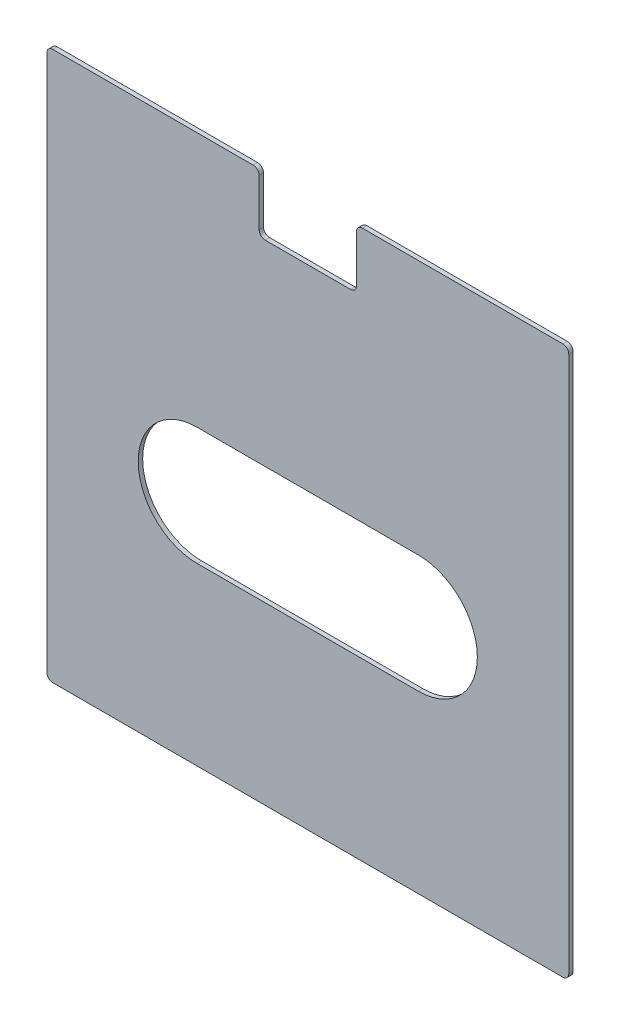
ISO-10303-21;
HEADER;
FILE_DESCRIPTION(('STEP AP214'),'2;1');
FILE_NAME('part.step','',(''),(''),'','','');
FILE_SCHEMA(('AUTOMOTIVE_DESIGN { 1 0 10303 214 1 1 1 1 }'));
ENDSEC;
DATA;
#1=APPLICATION_CONTEXT('core data for automotive mechanical design processes');
#2=APPLICATION_PROTOCOL_DEFINITION('international standard','automotive_design',2000,#1);
#3=PRODUCT_CONTEXT('',#1,'mechanical');
#4=PRODUCT('Part','Part','',(#3));
#5=PRODUCT_RELATED_PRODUCT_CATEGORY('part','',(#4));
#6=PRODUCT_DEFINITION_FORMATION('','',#4);
#7=PRODUCT_DEFINITION_CONTEXT('part definition',#1,'design');
#8=PRODUCT_DEFINITION('design','',#6,#7);
#9=PRODUCT_DEFINITION_SHAPE('','',#8);
#10=(LENGTH_UNIT() NAMED_UNIT(*) SI_UNIT(.MILLI.,.METRE.));
#11=(NAMED_UNIT(*) PLANE_ANGLE_UNIT() SI_UNIT($,.RADIAN.));
#12=(NAMED_UNIT(*) SI_UNIT($,.STERADIAN.) SOLID_ANGLE_UNIT());
#13=UNCERTAINTY_MEASURE_WITH_UNIT(LENGTH_MEASURE(1.E-05),#10,'distance_accuracy_value','');
#14=(GEOMETRIC_REPRESENTATION_CONTEXT(3) GLOBAL_UNCERTAINTY_ASSIGNED_CONTEXT((#13)) GLOBAL_UNIT_ASSIGNED_CONTEXT((#10,
#11,#12)) REPRESENTATION_CONTEXT('',''));
#15=CARTESIAN_POINT('',(0.,0.,0.));
#16=DIRECTION('',(0.,0.,1.));
#17=DIRECTION('',(1.,0.,0.));
#18=AXIS2_PLACEMENT_3D('',#15,#16,#17);
#19=CARTESIAN_POINT('',(0.,186.,1.5));
#20=DIRECTION('',(1.,0.,0.));
#21=DIRECTION('',(0.,1.,0.));
#22=AXIS2_PLACEMENT_3D('',#19,#20,#21);
#23=PLANE('',#22);
#24=DIRECTION('',(0.,-1.,0.));
#25=VECTOR('',#24,1.);
#26=CARTESIAN_POINT('',(0.,186.,0.));
#27=LINE('',#26,#25);
#28=CARTESIAN_POINT('',(0.,184.,0.));
#29=VERTEX_POINT('',#28);
#30=CARTESIAN_POINT('',(0.,2.00000000000006,0.));
#31=VERTEX_POINT('',#30);
#32=EDGE_CURVE('E204',#29,#31,#27,.T.);
#33=ORIENTED_EDGE('',*,*,#32,.T.);
#34=DIRECTION('',(0.,0.,-1.));
#35=VECTOR('',#34,1.);
#36=CARTESIAN_POINT('',(0.,2.,1.5));
#37=LINE('',#36,#35);
#38=CARTESIAN_POINT('',(0.,2.00000000000006,1.5));
#39=VERTEX_POINT('',#38);
#40=EDGE_CURVE('E314',#31,#39,#37,.F.);
#41=ORIENTED_EDGE('',*,*,#40,.T.);
#42=DIRECTION('',(0.,-1.,0.));
#43=VECTOR('',#42,1.);
#44=CARTESIAN_POINT('',(0.,186.,1.5));
#45=LINE('',#44,#43);
#46=CARTESIAN_POINT('',(0.,184.,1.5));
#47=VERTEX_POINT('',#46);
#48=EDGE_CURVE('E205',#47,#39,#45,.T.);
#49=ORIENTED_EDGE('',*,*,#48,.F.);
#50=DIRECTION('',(0.,0.,-1.));
#51=VECTOR('',#50,1.);
#52=CARTESIAN_POINT('',(0.,184.,1.5));
#53=LINE('',#52,#51);
#54=EDGE_CURVE('E311',#47,#29,#53,.T.);
#55=ORIENTED_EDGE('',*,*,#54,.T.);
#56=EDGE_LOOP('',(#33,#41,#49,#55));
#57=FACE_BOUND('',#56,.T.);
#58=ADVANCED_FACE('F33',(#57),#23,.F.);
#59=CARTESIAN_POINT('',(0.,0.,1.5));
#60=DIRECTION('',(0.,1.,0.));
#61=DIRECTION('',(-1.,0.,0.));
#62=AXIS2_PLACEMENT_3D('',#59,#60,#61);
#63=PLANE('',#62);
#64=DIRECTION('',(1.,0.,0.));
#65=VECTOR('',#64,1.);
#66=CARTESIAN_POINT('',(0.,0.,0.));
#67=LINE('',#66,#65);
#68=CARTESIAN_POINT('',(2.,0.,0.));
#69=VERTEX_POINT('',#68);
#70=CARTESIAN_POINT('',(175.,0.,0.));
#71=VERTEX_POINT('',#70);
#72=EDGE_CURVE('E233',#69,#71,#67,.T.);
#73=ORIENTED_EDGE('',*,*,#72,.T.);
#74=DIRECTION('',(0.,0.,-1.));
#75=VECTOR('',#74,1.);
#76=CARTESIAN_POINT('',(175.,0.,1.5));
#77=LINE('',#76,#75);
#78=CARTESIAN_POINT('',(175.,0.,1.5));
#79=VERTEX_POINT('',#78);
#80=EDGE_CURVE('E309',#71,#79,#77,.F.);
#81=ORIENTED_EDGE('',*,*,#80,.T.);
#82=DIRECTION('',(1.,0.,0.));
#83=VECTOR('',#82,1.);
#84=CARTESIAN_POINT('',(0.,0.,1.5));
#85=LINE('',#84,#83);
#86=CARTESIAN_POINT('',(2.,0.,1.5));
#87=VERTEX_POINT('',#86);
#88=EDGE_CURVE('E208',#87,#79,#85,.T.);
#89=ORIENTED_EDGE('',*,*,#88,.F.);
#90=DIRECTION('',(0.,0.,-1.));
#91=VECTOR('',#90,1.);
#92=CARTESIAN_POINT('',(2.,0.,1.5));
#93=LINE('',#92,#91);
#94=EDGE_CURVE('E306',#87,#69,#93,.T.);
#95=ORIENTED_EDGE('',*,*,#94,.T.);
#96=EDGE_LOOP('',(#73,#81,#89,#95));
#97=FACE_BOUND('',#96,.T.);
#98=ADVANCED_FACE('F360',(#97),#63,.F.);
#99=CARTESIAN_POINT('',(177.,0.,1.5));
#100=DIRECTION('',(-1.,0.,0.));
#101=DIRECTION('',(0.,-1.,0.));
#102=AXIS2_PLACEMENT_3D('',#99,#100,#101);
#103=PLANE('',#102);
#104=DIRECTION('',(0.,1.,0.));
#105=VECTOR('',#104,1.);
#106=CARTESIAN_POINT('',(177.,0.,1.5));
#107=LINE('',#106,#105);
#108=CARTESIAN_POINT('',(177.,2.00000000000001,1.5));
#109=VERTEX_POINT('',#108);
#110=CARTESIAN_POINT('',(177.,184.,1.5));
#111=VERTEX_POINT('',#110);
#112=EDGE_CURVE('E212',#109,#111,#107,.T.);
#113=ORIENTED_EDGE('',*,*,#112,.F.);
#114=DIRECTION('',(0.,0.,-1.));
#115=VECTOR('',#114,1.);
#116=CARTESIAN_POINT('',(177.,2.00000000000001,1.5));
#117=LINE('',#116,#115);
#118=CARTESIAN_POINT('',(177.,2.00000000000001,0.));
#119=VERTEX_POINT('',#118);
#120=EDGE_CURVE('E303',#109,#119,#117,.T.);
#121=ORIENTED_EDGE('',*,*,#120,.T.);
#122=DIRECTION('',(0.,1.,0.));
#123=VECTOR('',#122,1.);
#124=CARTESIAN_POINT('',(177.,0.,0.));
#125=LINE('',#124,#123);
#126=CARTESIAN_POINT('',(177.,184.,0.));
#127=VERTEX_POINT('',#126);
#128=EDGE_CURVE('E236',#119,#127,#125,.T.);
#129=ORIENTED_EDGE('',*,*,#128,.T.);
#130=DIRECTION('',(0.,0.,-1.));
#131=VECTOR('',#130,1.);
#132=CARTESIAN_POINT('',(177.,184.,1.5));
#133=LINE('',#132,#131);
#134=EDGE_CURVE('E301',#127,#111,#133,.F.);
#135=ORIENTED_EDGE('',*,*,#134,.T.);
#136=EDGE_LOOP('',(#113,#121,#129,#135));
#137=FACE_BOUND('',#136,.T.);
#138=ADVANCED_FACE('F369',(#137),#103,.F.);
#139=CARTESIAN_POINT('',(177.,186.,1.5));
#140=DIRECTION('',(0.,-1.,0.));
#141=DIRECTION('',(0.,0.,-1.));
#142=AXIS2_PLACEMENT_3D('',#139,#140,#141);
#143=PLANE('',#142);
#144=DIRECTION('',(-1.,0.,0.));
#145=VECTOR('',#144,1.);
#146=CARTESIAN_POINT('',(177.,186.,0.));
#147=LINE('',#146,#145);
#148=CARTESIAN_POINT('',(175.,186.,0.));
#149=VERTEX_POINT('',#148);
#150=CARTESIAN_POINT('',(107.,186.,0.));
#151=VERTEX_POINT('',#150);
#152=EDGE_CURVE('E239',#149,#151,#147,.T.);
#153=ORIENTED_EDGE('',*,*,#152,.T.);
#154=DIRECTION('',(0.,0.,-1.));
#155=VECTOR('',#154,1.);
#156=CARTESIAN_POINT('',(107.,186.,1.5));
#157=LINE('',#156,#155);
#158=CARTESIAN_POINT('',(107.,186.,1.5));
#159=VERTEX_POINT('',#158);
#160=EDGE_CURVE('E282',#151,#159,#157,.F.);
#161=ORIENTED_EDGE('',*,*,#160,.T.);
#162=DIRECTION('',(-1.,0.,0.));
#163=VECTOR('',#162,1.);
#164=CARTESIAN_POINT('',(177.,186.,1.5));
#165=LINE('',#164,#163);
#166=CARTESIAN_POINT('',(175.,186.,1.5));
#167=VERTEX_POINT('',#166);
#168=EDGE_CURVE('E215',#167,#159,#165,.T.);
#169=ORIENTED_EDGE('',*,*,#168,.F.);
#170=DIRECTION('',(0.,0.,-1.));
#171=VECTOR('',#170,1.);
#172=CARTESIAN_POINT('',(175.,186.,1.5));
#173=LINE('',#172,#171);
#174=EDGE_CURVE('E279',#167,#149,#173,.T.);
#175=ORIENTED_EDGE('',*,*,#174,.T.);
#176=EDGE_LOOP('',(#153,#161,#169,#175));
#177=FACE_BOUND('',#176,.T.);
#178=ADVANCED_FACE('F378',(#177),#143,.F.);
#179=CARTESIAN_POINT('',(105.,186.,1.5));
#180=DIRECTION('',(1.,0.,0.));
#181=DIRECTION('',(0.,1.,0.));
#182=AXIS2_PLACEMENT_3D('',#179,#180,#181);
#183=PLANE('',#182);
#184=DIRECTION('',(0.,-1.,0.));
#185=VECTOR('',#184,1.);
#186=CARTESIAN_POINT('',(105.,186.,0.));
#187=LINE('',#186,#185);
#188=CARTESIAN_POINT('',(105.,184.,0.));
#189=VERTEX_POINT('',#188);
#190=CARTESIAN_POINT('',(105.,168.,0.));
#191=VERTEX_POINT('',#190);
#192=EDGE_CURVE('E242',#189,#191,#187,.T.);
#193=ORIENTED_EDGE('',*,*,#192,.T.);
#194=DIRECTION('',(0.,0.,-1.));
#195=VECTOR('',#194,1.);
#196=CARTESIAN_POINT('',(105.,168.,1.5));
#197=LINE('',#196,#195);
#198=CARTESIAN_POINT('',(105.,168.,1.5));
#199=VERTEX_POINT('',#198);
#200=EDGE_CURVE('E260',#191,#199,#197,.F.);
#201=ORIENTED_EDGE('',*,*,#200,.T.);
#202=DIRECTION('',(0.,-1.,0.));
#203=VECTOR('',#202,1.);
#204=CARTESIAN_POINT('',(105.,186.,1.5));
#205=LINE('',#204,#203);
#206=CARTESIAN_POINT('',(105.,184.,1.5));
#207=VERTEX_POINT('',#206);
#208=EDGE_CURVE('E218',#207,#199,#205,.T.);
#209=ORIENTED_EDGE('',*,*,#208,.F.);
#210=DIRECTION('',(0.,0.,-1.));
#211=VECTOR('',#210,1.);
#212=CARTESIAN_POINT('',(105.,184.,1.5));
#213=LINE('',#212,#211);
#214=EDGE_CURVE('E257',#207,#189,#213,.T.);
#215=ORIENTED_EDGE('',*,*,#214,.T.);
#216=EDGE_LOOP('',(#193,#201,#209,#215));
#217=FACE_BOUND('',#216,.T.);
#218=ADVANCED_FACE('F387',(#217),#183,.F.);
#219=CARTESIAN_POINT('',(105.,166.,1.5));
#220=DIRECTION('',(0.,-1.,0.));
#221=DIRECTION('',(0.,0.,-1.));
#222=AXIS2_PLACEMENT_3D('',#219,#220,#221);
#223=PLANE('',#222);
#224=DIRECTION('',(-1.,0.,0.));
#225=VECTOR('',#224,1.);
#226=CARTESIAN_POINT('',(105.,166.,1.5));
#227=LINE('',#226,#225);
#228=CARTESIAN_POINT('',(103.,166.,1.5));
#229=VERTEX_POINT('',#228);
#230=CARTESIAN_POINT('',(74.,166.,1.5));
#231=VERTEX_POINT('',#230);
#232=EDGE_CURVE('E221',#229,#231,#227,.T.);
#233=ORIENTED_EDGE('',*,*,#232,.F.);
#234=DIRECTION('',(0.,0.,-1.));
#235=VECTOR('',#234,1.);
#236=CARTESIAN_POINT('',(103.,166.,0.));
#237=LINE('',#236,#235);
#238=CARTESIAN_POINT('',(103.,166.,0.));
#239=VERTEX_POINT('',#238);
#240=EDGE_CURVE('E254',#229,#239,#237,.T.);
#241=ORIENTED_EDGE('',*,*,#240,.T.);
#242=DIRECTION('',(-1.,0.,0.));
#243=VECTOR('',#242,1.);
#244=CARTESIAN_POINT('',(105.,166.,0.));
#245=LINE('',#244,#243);
#246=CARTESIAN_POINT('',(74.,166.,0.));
#247=VERTEX_POINT('',#246);
#248=EDGE_CURVE('E245',#239,#247,#245,.T.);
#249=ORIENTED_EDGE('',*,*,#248,.T.);
#250=DIRECTION('',(0.,0.,-1.));
#251=VECTOR('',#250,1.);
#252=CARTESIAN_POINT('',(74.,166.,1.5));
#253=LINE('',#252,#251);
#254=EDGE_CURVE('E230',#247,#231,#253,.F.);
#255=ORIENTED_EDGE('',*,*,#254,.T.);
#256=EDGE_LOOP('',(#233,#241,#249,#255));
#257=FACE_BOUND('',#256,.T.);
#258=ADVANCED_FACE('F327',(#257),#223,.F.);
#259=CARTESIAN_POINT('',(72.,166.,1.5));
#260=DIRECTION('',(-1.,0.,0.));
#261=DIRECTION('',(0.,0.,1.));
#262=AXIS2_PLACEMENT_3D('',#259,#260,#261);
#263=PLANE('',#262);
#264=DIRECTION('',(0.,1.,0.));
#265=VECTOR('',#264,1.);
#266=CARTESIAN_POINT('',(72.,166.,1.5));
#267=LINE('',#266,#265);
#268=CARTESIAN_POINT('',(72.,168.,1.5));
#269=VERTEX_POINT('',#268);
#270=CARTESIAN_POINT('',(72.,184.,1.5));
#271=VERTEX_POINT('',#270);
#272=EDGE_CURVE('E224',#269,#271,#267,.T.);
#273=ORIENTED_EDGE('',*,*,#272,.F.);
#274=DIRECTION('',(0.,0.,-1.));
#275=VECTOR('',#274,1.);
#276=CARTESIAN_POINT('',(72.,168.,0.));
#277=LINE('',#276,#275);
#278=CARTESIAN_POINT('',(72.,168.,0.));
#279=VERTEX_POINT('',#278);
#280=EDGE_CURVE('E264',#269,#279,#277,.T.);
#281=ORIENTED_EDGE('',*,*,#280,.T.);
#282=DIRECTION('',(0.,1.,0.));
#283=VECTOR('',#282,1.);
#284=CARTESIAN_POINT('',(72.,166.,0.));
#285=LINE('',#284,#283);
#286=CARTESIAN_POINT('',(72.,184.,0.));
#287=VERTEX_POINT('',#286);
#288=EDGE_CURVE('E248',#279,#287,#285,.T.);
#289=ORIENTED_EDGE('',*,*,#288,.T.);
#290=DIRECTION('',(0.,0.,-1.));
#291=VECTOR('',#290,1.);
#292=CARTESIAN_POINT('',(72.,184.,1.5));
#293=LINE('',#292,#291);
#294=EDGE_CURVE('E262',#287,#271,#293,.F.);
#295=ORIENTED_EDGE('',*,*,#294,.T.);
#296=EDGE_LOOP('',(#273,#281,#289,#295));
#297=FACE_BOUND('',#296,.T.);
#298=ADVANCED_FACE('F336',(#297),#263,.F.);
#299=CARTESIAN_POINT('',(72.,186.,1.5));
#300=DIRECTION('',(0.,-1.,0.));
#301=DIRECTION('',(0.,0.,-1.));
#302=AXIS2_PLACEMENT_3D('',#299,#300,#301);
#303=PLANE('',#302);
#304=DIRECTION('',(-1.,0.,0.));
#305=VECTOR('',#304,1.);
#306=CARTESIAN_POINT('',(72.,186.,1.5));
#307=LINE('',#306,#305);
#308=CARTESIAN_POINT('',(70.,186.,1.5));
#309=VERTEX_POINT('',#308);
#310=CARTESIAN_POINT('',(1.99999999999999,186.,1.5));
#311=VERTEX_POINT('',#310);
#312=EDGE_CURVE('E227',#309,#311,#307,.T.);
#313=ORIENTED_EDGE('',*,*,#312,.F.);
#314=DIRECTION('',(0.,0.,-1.));
#315=VECTOR('',#314,1.);
#316=CARTESIAN_POINT('',(70.,186.,1.5));
#317=LINE('',#316,#315);
#318=CARTESIAN_POINT('',(70.,186.,0.));
#319=VERTEX_POINT('',#318);
#320=EDGE_CURVE('E298',#309,#319,#317,.T.);
#321=ORIENTED_EDGE('',*,*,#320,.T.);
#322=DIRECTION('',(-1.,0.,0.));
#323=VECTOR('',#322,1.);
#324=CARTESIAN_POINT('',(72.,186.,0.));
#325=LINE('',#324,#323);
#326=CARTESIAN_POINT('',(1.99999999999999,186.,0.));
#327=VERTEX_POINT('',#326);
#328=EDGE_CURVE('E209',#319,#327,#325,.T.);
#329=ORIENTED_EDGE('',*,*,#328,.T.);
#330=DIRECTION('',(0.,0.,-1.));
#331=VECTOR('',#330,1.);
#332=CARTESIAN_POINT('',(1.99999999999999,186.,1.5));
#333=LINE('',#332,#331);
#334=EDGE_CURVE('E296',#327,#311,#333,.F.);
#335=ORIENTED_EDGE('',*,*,#334,.T.);
#336=EDGE_LOOP('',(#313,#321,#329,#335));
#337=FACE_BOUND('',#336,.T.);
#338=ADVANCED_FACE('F344',(#337),#303,.F.);
#339=CARTESIAN_POINT('',(0.,0.,1.5));
#340=DIRECTION('',(0.,0.,1.));
#341=DIRECTION('',(1.,0.,0.));
#342=AXIS2_PLACEMENT_3D('',#339,#340,#341);
#343=PLANE('',#342);
#344=CARTESIAN_POINT('',(126.,79.5,1.5));
#345=DIRECTION('',(0.,0.,1.));
#346=DIRECTION('',(1.,0.,0.));
#347=AXIS2_PLACEMENT_3D('',#344,#345,#346);
#348=CIRCLE('',#347,20.);
#349=CARTESIAN_POINT('',(126.,59.5000000000001,1.5));
#350=VERTEX_POINT('',#349);
#351=CARTESIAN_POINT('',(126.,99.5,1.5));
#352=VERTEX_POINT('',#351);
#353=EDGE_CURVE('E202',#350,#352,#348,.T.);
#354=ORIENTED_EDGE('',*,*,#353,.F.);
#355=DIRECTION('',(1.,0.,0.));
#356=VECTOR('',#355,1.);
#357=CARTESIAN_POINT('',(0.,59.5000000000001,1.5));
#358=LINE('',#357,#356);
#359=CARTESIAN_POINT('',(51.,59.5000000000001,1.5));
#360=VERTEX_POINT('',#359);
#361=EDGE_CURVE('E195',#360,#350,#358,.T.);
#362=ORIENTED_EDGE('',*,*,#361,.F.);
#363=CARTESIAN_POINT('',(51.,79.5,1.5));
#364=DIRECTION('',(0.,0.,1.));
#365=DIRECTION('',(1.,0.,0.));
#366=AXIS2_PLACEMENT_3D('',#363,#364,#365);
#367=CIRCLE('',#366,20.);
#368=CARTESIAN_POINT('',(51.,99.5,1.5));
#369=VERTEX_POINT('',#368);
#370=EDGE_CURVE('E175',#369,#360,#367,.T.);
#371=ORIENTED_EDGE('',*,*,#370,.F.);
#372=DIRECTION('',(-1.,0.,0.));
#373=VECTOR('',#372,1.);
#374=CARTESIAN_POINT('',(0.,99.5,1.5));
#375=LINE('',#374,#373);
#376=EDGE_CURVE('E200',#352,#369,#375,.T.);
#377=ORIENTED_EDGE('',*,*,#376,.F.);
#378=EDGE_LOOP('',(#354,#362,#371,#377));
#379=FACE_BOUND('',#378,.T.);
#380=ORIENTED_EDGE('',*,*,#168,.T.);
#381=CARTESIAN_POINT('',(107.,184.,1.5));
#382=DIRECTION('',(0.,0.,1.));
#383=DIRECTION('',(1.,0.,0.));
#384=AXIS2_PLACEMENT_3D('',#381,#382,#383);
#385=CIRCLE('',#384,2.);
#386=EDGE_CURVE('E294',#159,#207,#385,.T.);
#387=ORIENTED_EDGE('',*,*,#386,.T.);
#388=ORIENTED_EDGE('',*,*,#208,.T.);
#389=CARTESIAN_POINT('',(103.,168.,1.5));
#390=DIRECTION('',(0.,0.,1.));
#391=DIRECTION('',(1.,0.,0.));
#392=AXIS2_PLACEMENT_3D('',#389,#390,#391);
#393=CIRCLE('',#392,2.);
#394=EDGE_CURVE('E318',#199,#229,#393,.F.);
#395=ORIENTED_EDGE('',*,*,#394,.T.);
#396=ORIENTED_EDGE('',*,*,#232,.T.);
#397=CARTESIAN_POINT('',(74.,168.,1.5));
#398=DIRECTION('',(0.,0.,1.));
#399=DIRECTION('',(1.,0.,0.));
#400=AXIS2_PLACEMENT_3D('',#397,#398,#399);
#401=CIRCLE('',#400,2.);
#402=EDGE_CURVE('E11',#231,#269,#401,.F.);
#403=ORIENTED_EDGE('',*,*,#402,.T.);
#404=ORIENTED_EDGE('',*,*,#272,.T.);
#405=CARTESIAN_POINT('',(70.,184.,1.5));
#406=DIRECTION('',(0.,0.,1.));
#407=DIRECTION('',(1.,0.,0.));
#408=AXIS2_PLACEMENT_3D('',#405,#406,#407);
#409=CIRCLE('',#408,2.);
#410=EDGE_CURVE('E292',#271,#309,#409,.T.);
#411=ORIENTED_EDGE('',*,*,#410,.T.);
#412=ORIENTED_EDGE('',*,*,#312,.T.);
#413=CARTESIAN_POINT('',(1.99999999999998,184.,1.5));
#414=DIRECTION('',(0.,0.,1.));
#415=DIRECTION('',(1.,0.,0.));
#416=AXIS2_PLACEMENT_3D('',#413,#414,#415);
#417=CIRCLE('',#416,2.);
#418=EDGE_CURVE('E284',#311,#47,#417,.T.);
#419=ORIENTED_EDGE('',*,*,#418,.T.);
#420=ORIENTED_EDGE('',*,*,#48,.T.);
#421=CARTESIAN_POINT('',(2.,2.,1.5));
#422=DIRECTION('',(0.,0.,1.));
#423=DIRECTION('',(1.,0.,0.));
#424=AXIS2_PLACEMENT_3D('',#421,#422,#423);
#425=CIRCLE('',#424,2.);
#426=EDGE_CURVE('E288',#39,#87,#425,.T.);
#427=ORIENTED_EDGE('',*,*,#426,.T.);
#428=ORIENTED_EDGE('',*,*,#88,.T.);
#429=CARTESIAN_POINT('',(175.,2.00000000000001,1.5));
#430=DIRECTION('',(0.,0.,1.));
#431=DIRECTION('',(1.,0.,0.));
#432=AXIS2_PLACEMENT_3D('',#429,#430,#431);
#433=CIRCLE('',#432,2.);
#434=EDGE_CURVE('E290',#79,#109,#433,.T.);
#435=ORIENTED_EDGE('',*,*,#434,.T.);
#436=ORIENTED_EDGE('',*,*,#112,.T.);
#437=CARTESIAN_POINT('',(175.,184.,1.5));
#438=DIRECTION('',(0.,0.,1.));
#439=DIRECTION('',(1.,0.,0.));
#440=AXIS2_PLACEMENT_3D('',#437,#438,#439);
#441=CIRCLE('',#440,2.);
#442=EDGE_CURVE('E286',#111,#167,#441,.T.);
#443=ORIENTED_EDGE('',*,*,#442,.T.);
#444=EDGE_LOOP('',(#380,#387,#388,#395,#396,#403,#404,#411,#412,#419,#420,#427,#428,#435,#436,#443));
#445=FACE_BOUND('',#444,.T.);
#446=ADVANCED_FACE('F333',(#379,#445),#343,.T.);
#447=CARTESIAN_POINT('',(0.,0.,0.));
#448=DIRECTION('',(0.,0.,1.));
#449=DIRECTION('',(1.,0.,0.));
#450=AXIS2_PLACEMENT_3D('',#447,#448,#449);
#451=PLANE('',#450);
#452=DIRECTION('',(-1.,0.,0.));
#453=VECTOR('',#452,1.);
#454=CARTESIAN_POINT('',(126.,59.5000000000001,0.));
#455=LINE('',#454,#453);
#456=CARTESIAN_POINT('',(126.,59.5000000000001,0.));
#457=VERTEX_POINT('',#456);
#458=CARTESIAN_POINT('',(51.,59.5000000000001,0.));
#459=VERTEX_POINT('',#458);
#460=EDGE_CURVE('E181',#457,#459,#455,.T.);
#461=ORIENTED_EDGE('',*,*,#460,.F.);
#462=CARTESIAN_POINT('',(126.,79.5,0.));
#463=DIRECTION('',(0.,0.,-1.));
#464=DIRECTION('',(-1.,0.,0.));
#465=AXIS2_PLACEMENT_3D('',#462,#463,#464);
#466=CIRCLE('',#465,20.);
#467=CARTESIAN_POINT('',(126.,99.5,0.));
#468=VERTEX_POINT('',#467);
#469=EDGE_CURVE('E56',#468,#457,#466,.T.);
#470=ORIENTED_EDGE('',*,*,#469,.F.);
#471=DIRECTION('',(1.,0.,0.));
#472=VECTOR('',#471,1.);
#473=CARTESIAN_POINT('',(126.,99.5,0.));
#474=LINE('',#473,#472);
#475=CARTESIAN_POINT('',(51.,99.5,0.));
#476=VERTEX_POINT('',#475);
#477=EDGE_CURVE('E188',#476,#468,#474,.T.);
#478=ORIENTED_EDGE('',*,*,#477,.F.);
#479=CARTESIAN_POINT('',(51.,79.5,0.));
#480=DIRECTION('',(0.,0.,-1.));
#481=DIRECTION('',(-1.,0.,0.));
#482=AXIS2_PLACEMENT_3D('',#479,#480,#481);
#483=CIRCLE('',#482,20.);
#484=EDGE_CURVE('E172',#459,#476,#483,.T.);
#485=ORIENTED_EDGE('',*,*,#484,.F.);
#486=EDGE_LOOP('',(#461,#470,#478,#485));
#487=FACE_BOUND('',#486,.T.);
#488=ORIENTED_EDGE('',*,*,#192,.F.);
#489=CARTESIAN_POINT('',(107.,184.,0.));
#490=DIRECTION('',(0.,0.,1.));
#491=DIRECTION('',(1.,0.,0.));
#492=AXIS2_PLACEMENT_3D('',#489,#490,#491);
#493=CIRCLE('',#492,2.);
#494=EDGE_CURVE('E277',#189,#151,#493,.F.);
#495=ORIENTED_EDGE('',*,*,#494,.T.);
#496=ORIENTED_EDGE('',*,*,#152,.F.);
#497=CARTESIAN_POINT('',(175.,184.,0.));
#498=DIRECTION('',(0.,0.,1.));
#499=DIRECTION('',(1.,0.,0.));
#500=AXIS2_PLACEMENT_3D('',#497,#498,#499);
#501=CIRCLE('',#500,2.);
#502=EDGE_CURVE('E269',#149,#127,#501,.F.);
#503=ORIENTED_EDGE('',*,*,#502,.T.);
#504=ORIENTED_EDGE('',*,*,#128,.F.);
#505=CARTESIAN_POINT('',(175.,2.00000000000001,0.));
#506=DIRECTION('',(0.,0.,1.));
#507=DIRECTION('',(1.,0.,0.));
#508=AXIS2_PLACEMENT_3D('',#505,#506,#507);
#509=CIRCLE('',#508,2.);
#510=EDGE_CURVE('E273',#119,#71,#509,.F.);
#511=ORIENTED_EDGE('',*,*,#510,.T.);
#512=ORIENTED_EDGE('',*,*,#72,.F.);
#513=CARTESIAN_POINT('',(2.,2.,0.));
#514=DIRECTION('',(0.,0.,1.));
#515=DIRECTION('',(1.,0.,0.));
#516=AXIS2_PLACEMENT_3D('',#513,#514,#515);
#517=CIRCLE('',#516,2.);
#518=EDGE_CURVE('E271',#69,#31,#517,.F.);
#519=ORIENTED_EDGE('',*,*,#518,.T.);
#520=ORIENTED_EDGE('',*,*,#32,.F.);
#521=CARTESIAN_POINT('',(1.99999999999998,184.,0.));
#522=DIRECTION('',(0.,0.,1.));
#523=DIRECTION('',(1.,0.,0.));
#524=AXIS2_PLACEMENT_3D('',#521,#522,#523);
#525=CIRCLE('',#524,2.);
#526=EDGE_CURVE('E267',#29,#327,#525,.F.);
#527=ORIENTED_EDGE('',*,*,#526,.T.);
#528=ORIENTED_EDGE('',*,*,#328,.F.);
#529=CARTESIAN_POINT('',(70.,184.,0.));
#530=DIRECTION('',(0.,0.,1.));
#531=DIRECTION('',(1.,0.,0.));
#532=AXIS2_PLACEMENT_3D('',#529,#530,#531);
#533=CIRCLE('',#532,2.);
#534=EDGE_CURVE('E275',#319,#287,#533,.F.);
#535=ORIENTED_EDGE('',*,*,#534,.T.);
#536=ORIENTED_EDGE('',*,*,#288,.F.);
#537=CARTESIAN_POINT('',(74.,168.,0.));
#538=DIRECTION('',(0.,0.,1.));
#539=DIRECTION('',(1.,0.,0.));
#540=AXIS2_PLACEMENT_3D('',#537,#538,#539);
#541=CIRCLE('',#540,2.);
#542=EDGE_CURVE('E41',#279,#247,#541,.T.);
#543=ORIENTED_EDGE('',*,*,#542,.T.);
#544=ORIENTED_EDGE('',*,*,#248,.F.);
#545=CARTESIAN_POINT('',(103.,168.,0.));
#546=DIRECTION('',(0.,0.,1.));
#547=DIRECTION('',(1.,0.,0.));
#548=AXIS2_PLACEMENT_3D('',#545,#546,#547);
#549=CIRCLE('',#548,2.);
#550=EDGE_CURVE('E316',#239,#191,#549,.T.);
#551=ORIENTED_EDGE('',*,*,#550,.T.);
#552=EDGE_LOOP('',(#488,#495,#496,#503,#504,#511,#512,#519,#520,#527,#528,#535,#536,#543,#544,#551));
#553=FACE_BOUND('',#552,.T.);
#554=ADVANCED_FACE('F185',(#487,#553),#451,.F.);
#555=CARTESIAN_POINT('',(103.,168.,1.5));
#556=DIRECTION('',(0.,0.,1.));
#557=DIRECTION('',(1.,0.,0.));
#558=AXIS2_PLACEMENT_3D('',#555,#556,#557);
#559=CYLINDRICAL_SURFACE('',#558,2.);
#560=ORIENTED_EDGE('',*,*,#394,.F.);
#561=ORIENTED_EDGE('',*,*,#200,.F.);
#562=ORIENTED_EDGE('',*,*,#550,.F.);
#563=ORIENTED_EDGE('',*,*,#240,.F.);
#564=EDGE_LOOP('',(#560,#561,#562,#563));
#565=FACE_BOUND('',#564,.T.);
#566=ADVANCED_FACE('F390',(#565),#559,.F.);
#567=CARTESIAN_POINT('',(74.,168.,1.5));
#568=DIRECTION('',(0.,0.,1.));
#569=DIRECTION('',(1.,0.,0.));
#570=AXIS2_PLACEMENT_3D('',#567,#568,#569);
#571=CYLINDRICAL_SURFACE('',#570,2.);
#572=ORIENTED_EDGE('',*,*,#402,.F.);
#573=ORIENTED_EDGE('',*,*,#254,.F.);
#574=ORIENTED_EDGE('',*,*,#542,.F.);
#575=ORIENTED_EDGE('',*,*,#280,.F.);
#576=EDGE_LOOP('',(#572,#573,#574,#575));
#577=FACE_BOUND('',#576,.T.);
#578=ADVANCED_FACE('F330',(#577),#571,.F.);
#579=CARTESIAN_POINT('',(107.,184.,1.5));
#580=DIRECTION('',(0.,0.,-1.));
#581=DIRECTION('',(-1.,0.,0.));
#582=AXIS2_PLACEMENT_3D('',#579,#580,#581);
#583=CYLINDRICAL_SURFACE('',#582,2.);
#584=ORIENTED_EDGE('',*,*,#386,.F.);
#585=ORIENTED_EDGE('',*,*,#160,.F.);
#586=ORIENTED_EDGE('',*,*,#494,.F.);
#587=ORIENTED_EDGE('',*,*,#214,.F.);
#588=EDGE_LOOP('',(#584,#585,#586,#587));
#589=FACE_BOUND('',#588,.T.);
#590=ADVANCED_FACE('F382',(#589),#583,.T.);
#591=CARTESIAN_POINT('',(70.,184.,1.5));
#592=DIRECTION('',(0.,0.,-1.));
#593=DIRECTION('',(-1.,0.,0.));
#594=AXIS2_PLACEMENT_3D('',#591,#592,#593);
#595=CYLINDRICAL_SURFACE('',#594,2.);
#596=ORIENTED_EDGE('',*,*,#410,.F.);
#597=ORIENTED_EDGE('',*,*,#294,.F.);
#598=ORIENTED_EDGE('',*,*,#534,.F.);
#599=ORIENTED_EDGE('',*,*,#320,.F.);
#600=EDGE_LOOP('',(#596,#597,#598,#599));
#601=FACE_BOUND('',#600,.T.);
#602=ADVANCED_FACE('F339',(#601),#595,.T.);
#603=CARTESIAN_POINT('',(175.,2.00000000000001,1.5));
#604=DIRECTION('',(0.,0.,-1.));
#605=DIRECTION('',(-1.,0.,0.));
#606=AXIS2_PLACEMENT_3D('',#603,#604,#605);
#607=CYLINDRICAL_SURFACE('',#606,2.);
#608=ORIENTED_EDGE('',*,*,#434,.F.);
#609=ORIENTED_EDGE('',*,*,#80,.F.);
#610=ORIENTED_EDGE('',*,*,#510,.F.);
#611=ORIENTED_EDGE('',*,*,#120,.F.);
#612=EDGE_LOOP('',(#608,#609,#610,#611));
#613=FACE_BOUND('',#612,.T.);
#614=ADVANCED_FACE('F364',(#613),#607,.T.);
#615=CARTESIAN_POINT('',(2.,2.,1.5));
#616=DIRECTION('',(0.,0.,-1.));
#617=DIRECTION('',(-1.,0.,0.));
#618=AXIS2_PLACEMENT_3D('',#615,#616,#617);
#619=CYLINDRICAL_SURFACE('',#618,2.);
#620=ORIENTED_EDGE('',*,*,#426,.F.);
#621=ORIENTED_EDGE('',*,*,#40,.F.);
#622=ORIENTED_EDGE('',*,*,#518,.F.);
#623=ORIENTED_EDGE('',*,*,#94,.F.);
#624=EDGE_LOOP('',(#620,#621,#622,#623));
#625=FACE_BOUND('',#624,.T.);
#626=ADVANCED_FACE('F355',(#625),#619,.T.);
#627=CARTESIAN_POINT('',(175.,184.,1.5));
#628=DIRECTION('',(0.,0.,-1.));
#629=DIRECTION('',(-1.,0.,0.));
#630=AXIS2_PLACEMENT_3D('',#627,#628,#629);
#631=CYLINDRICAL_SURFACE('',#630,2.);
#632=ORIENTED_EDGE('',*,*,#442,.F.);
#633=ORIENTED_EDGE('',*,*,#134,.F.);
#634=ORIENTED_EDGE('',*,*,#502,.F.);
#635=ORIENTED_EDGE('',*,*,#174,.F.);
#636=EDGE_LOOP('',(#632,#633,#634,#635));
#637=FACE_BOUND('',#636,.T.);
#638=ADVANCED_FACE('F373',(#637),#631,.T.);
#639=CARTESIAN_POINT('',(1.99999999999998,184.,1.5));
#640=DIRECTION('',(0.,0.,-1.));
#641=DIRECTION('',(-1.,0.,0.));
#642=AXIS2_PLACEMENT_3D('',#639,#640,#641);
#643=CYLINDRICAL_SURFACE('',#642,2.);
#644=ORIENTED_EDGE('',*,*,#418,.F.);
#645=ORIENTED_EDGE('',*,*,#334,.F.);
#646=ORIENTED_EDGE('',*,*,#526,.F.);
#647=ORIENTED_EDGE('',*,*,#54,.F.);
#648=EDGE_LOOP('',(#644,#645,#646,#647));
#649=FACE_BOUND('',#648,.T.);
#650=ADVANCED_FACE('F35',(#649),#643,.T.);
#651=CARTESIAN_POINT('',(126.,79.5,10.));
#652=DIRECTION('',(0.,0.,-1.));
#653=DIRECTION('',(-1.,0.,0.));
#654=AXIS2_PLACEMENT_3D('',#651,#652,#653);
#655=CYLINDRICAL_SURFACE('',#654,20.);
#656=ORIENTED_EDGE('',*,*,#353,.T.);
#657=DIRECTION('',(0.,0.,-1.));
#658=VECTOR('',#657,1.);
#659=CARTESIAN_POINT('',(126.,99.5,10.));
#660=LINE('',#659,#658);
#661=EDGE_CURVE('E193',#352,#468,#660,.T.);
#662=ORIENTED_EDGE('',*,*,#661,.T.);
#663=ORIENTED_EDGE('',*,*,#469,.T.);
#664=DIRECTION('',(0.,0.,-1.));
#665=VECTOR('',#664,1.);
#666=CARTESIAN_POINT('',(126.,59.5000000000001,10.));
#667=LINE('',#666,#665);
#668=EDGE_CURVE('E178',#350,#457,#667,.T.);
#669=ORIENTED_EDGE('',*,*,#668,.F.);
#670=EDGE_LOOP('',(#656,#662,#663,#669));
#671=FACE_BOUND('',#670,.T.);
#672=ADVANCED_FACE('F421',(#671),#655,.F.);
#673=CARTESIAN_POINT('',(126.,99.5,10.));
#674=DIRECTION('',(0.,1.,0.));
#675=DIRECTION('',(0.,0.,1.));
#676=AXIS2_PLACEMENT_3D('',#673,#674,#675);
#677=PLANE('',#676);
#678=ORIENTED_EDGE('',*,*,#376,.T.);
#679=DIRECTION('',(0.,0.,-1.));
#680=VECTOR('',#679,1.);
#681=CARTESIAN_POINT('',(51.,99.5,10.));
#682=LINE('',#681,#680);
#683=EDGE_CURVE('E177',#369,#476,#682,.T.);
#684=ORIENTED_EDGE('',*,*,#683,.T.);
#685=ORIENTED_EDGE('',*,*,#477,.T.);
#686=ORIENTED_EDGE('',*,*,#661,.F.);
#687=EDGE_LOOP('',(#678,#684,#685,#686));
#688=FACE_BOUND('',#687,.T.);
#689=ADVANCED_FACE('F424',(#688),#677,.F.);
#690=CARTESIAN_POINT('',(51.,79.5,10.));
#691=DIRECTION('',(0.,0.,-1.));
#692=DIRECTION('',(-1.,0.,0.));
#693=AXIS2_PLACEMENT_3D('',#690,#691,#692);
#694=CYLINDRICAL_SURFACE('',#693,20.);
#695=ORIENTED_EDGE('',*,*,#370,.T.);
#696=DIRECTION('',(0.,0.,-1.));
#697=VECTOR('',#696,1.);
#698=CARTESIAN_POINT('',(51.,59.5000000000001,10.));
#699=LINE('',#698,#697);
#700=EDGE_CURVE('E48',#360,#459,#699,.T.);
#701=ORIENTED_EDGE('',*,*,#700,.T.);
#702=ORIENTED_EDGE('',*,*,#484,.T.);
#703=ORIENTED_EDGE('',*,*,#683,.F.);
#704=EDGE_LOOP('',(#695,#701,#702,#703));
#705=FACE_BOUND('',#704,.T.);
#706=ADVANCED_FACE('F169',(#705),#694,.F.);
#707=CARTESIAN_POINT('',(126.,59.5000000000001,10.));
#708=DIRECTION('',(0.,-1.,0.));
#709=DIRECTION('',(0.,0.,-1.));
#710=AXIS2_PLACEMENT_3D('',#707,#708,#709);
#711=PLANE('',#710);
#712=ORIENTED_EDGE('',*,*,#361,.T.);
#713=ORIENTED_EDGE('',*,*,#668,.T.);
#714=ORIENTED_EDGE('',*,*,#460,.T.);
#715=ORIENTED_EDGE('',*,*,#700,.F.);
#716=EDGE_LOOP('',(#712,#713,#714,#715));
#717=FACE_BOUND('',#716,.T.);
#718=ADVANCED_FACE('F182',(#717),#711,.F.);
#719=CLOSED_SHELL('',(#58,#98,#138,#178,#218,#258,#298,#338,#446,#554,#566,#578,#590,#602,#614,
#626,#638,#650,#672,#689,#706,#718));
#720=MANIFOLD_SOLID_BREP('B2',#719);
#721=ADVANCED_BREP_SHAPE_REPRESENTATION('',(#18,#720),#14);
#722=SHAPE_DEFINITION_REPRESENTATION(#9,#721);
ENDSEC;
END-ISO-10303-21;
